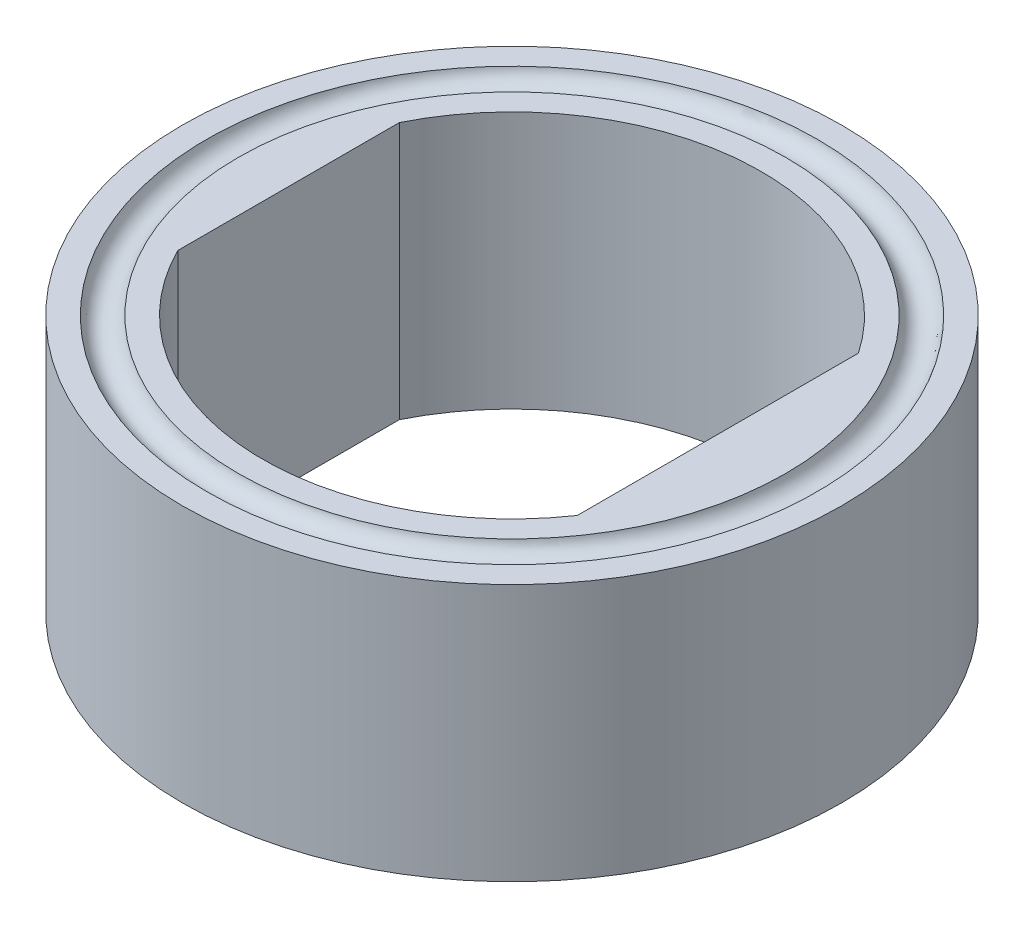
ISO-10303-21;
HEADER;
FILE_DESCRIPTION(('STEP AP214'),'2;1');
FILE_NAME('part.step','',(''),(''),'','','');
FILE_SCHEMA(('AUTOMOTIVE_DESIGN { 1 0 10303 214 1 1 1 1 }'));
ENDSEC;
DATA;
#1=APPLICATION_CONTEXT('core data for automotive mechanical design processes');
#2=APPLICATION_PROTOCOL_DEFINITION('international standard','automotive_design',2000,#1);
#3=PRODUCT_CONTEXT('',#1,'mechanical');
#4=PRODUCT('Part','Part','',(#3));
#5=PRODUCT_RELATED_PRODUCT_CATEGORY('part','',(#4));
#6=PRODUCT_DEFINITION_FORMATION('','',#4);
#7=PRODUCT_DEFINITION_CONTEXT('part definition',#1,'design');
#8=PRODUCT_DEFINITION('design','',#6,#7);
#9=PRODUCT_DEFINITION_SHAPE('','',#8);
#10=(LENGTH_UNIT() NAMED_UNIT(*) SI_UNIT(.MILLI.,.METRE.));
#11=(NAMED_UNIT(*) PLANE_ANGLE_UNIT() SI_UNIT($,.RADIAN.));
#12=(NAMED_UNIT(*) SI_UNIT($,.STERADIAN.) SOLID_ANGLE_UNIT());
#13=UNCERTAINTY_MEASURE_WITH_UNIT(LENGTH_MEASURE(1.E-05),#10,'distance_accuracy_value','');
#14=(GEOMETRIC_REPRESENTATION_CONTEXT(3) GLOBAL_UNCERTAINTY_ASSIGNED_CONTEXT((#13)) GLOBAL_UNIT_ASSIGNED_CONTEXT((#10,
#11,#12)) REPRESENTATION_CONTEXT('',''));
#15=CARTESIAN_POINT('',(0.,0.,0.));
#16=DIRECTION('',(0.,0.,1.));
#17=DIRECTION('',(1.,0.,0.));
#18=AXIS2_PLACEMENT_3D('',#15,#16,#17);
#19=CARTESIAN_POINT('',(0.,25.4,0.));
#20=DIRECTION('',(0.,-1.,0.));
#21=DIRECTION('',(0.,0.,-1.));
#22=AXIS2_PLACEMENT_3D('',#19,#20,#21);
#23=CYLINDRICAL_SURFACE('',#22,49.2125);
#24=DIRECTION('',(0.,1.,0.));
#25=VECTOR('',#24,1.);
#26=CARTESIAN_POINT('',(40.64,-25.4,-27.7535683516553));
#27=LINE('',#26,#25);
#28=CARTESIAN_POINT('',(40.64,-25.4,-27.7535683516553));
#29=VERTEX_POINT('',#28);
#30=CARTESIAN_POINT('',(40.64,25.4,-27.7535683516553));
#31=VERTEX_POINT('',#30);
#32=EDGE_CURVE('E96',#29,#31,#27,.T.);
#33=ORIENTED_EDGE('',*,*,#32,.T.);
#34=CARTESIAN_POINT('',(0.,25.4,0.));
#35=DIRECTION('',(0.,1.,0.));
#36=DIRECTION('',(0.,0.,1.));
#37=AXIS2_PLACEMENT_3D('',#34,#35,#36);
#38=CIRCLE('',#37,49.2125);
#39=CARTESIAN_POINT('',(-44.0944,25.4,-21.853009973228));
#40=VERTEX_POINT('',#39);
#41=EDGE_CURVE('E84',#31,#40,#38,.T.);
#42=ORIENTED_EDGE('',*,*,#41,.T.);
#43=DIRECTION('',(0.,1.,0.));
#44=VECTOR('',#43,1.);
#45=CARTESIAN_POINT('',(-44.0944,-25.4,-21.853009973228));
#46=LINE('',#45,#44);
#47=CARTESIAN_POINT('',(-44.0944,-25.4,-21.853009973228));
#48=VERTEX_POINT('',#47);
#49=EDGE_CURVE('E118',#48,#40,#46,.T.);
#50=ORIENTED_EDGE('',*,*,#49,.F.);
#51=CARTESIAN_POINT('',(0.,-25.4,0.));
#52=DIRECTION('',(0.,1.,0.));
#53=DIRECTION('',(0.,0.,1.));
#54=AXIS2_PLACEMENT_3D('',#51,#52,#53);
#55=CIRCLE('',#54,49.2125);
#56=EDGE_CURVE('E57',#29,#48,#55,.T.);
#57=ORIENTED_EDGE('',*,*,#56,.F.);
#58=EDGE_LOOP('',(#33,#42,#50,#57));
#59=FACE_BOUND('',#58,.T.);
#60=ADVANCED_FACE('F39',(#59),#23,.F.);
#61=CARTESIAN_POINT('',(0.,-25.4,0.));
#62=DIRECTION('',(0.,1.,0.));
#63=DIRECTION('',(0.,0.,1.));
#64=AXIS2_PLACEMENT_3D('',#61,#62,#63);
#65=PLANE('',#64);
#66=CARTESIAN_POINT('',(0.,-25.4,0.));
#67=DIRECTION('',(0.,1.,0.));
#68=DIRECTION('',(0.,0.,1.));
#69=AXIS2_PLACEMENT_3D('',#66,#67,#68);
#70=CIRCLE('',#69,65.0875);
#71=CARTESIAN_POINT('',(0.,-25.4,65.0875));
#72=VERTEX_POINT('',#71);
#73=EDGE_CURVE('E49',#72,#72,#70,.T.);
#74=ORIENTED_EDGE('',*,*,#73,.F.);
#75=EDGE_LOOP('',(#74));
#76=FACE_BOUND('',#75,.T.);
#77=CARTESIAN_POINT('',(0.,-25.4,0.));
#78=DIRECTION('',(0.,1.,0.));
#79=DIRECTION('',(0.,0.,1.));
#80=AXIS2_PLACEMENT_3D('',#77,#78,#79);
#81=CIRCLE('',#80,60.2608519733346);
#82=CARTESIAN_POINT('',(0.,-25.4,60.2608519733346));
#83=VERTEX_POINT('',#82);
#84=EDGE_CURVE('E43',#83,#83,#81,.T.);
#85=ORIENTED_EDGE('',*,*,#84,.T.);
#86=EDGE_LOOP('',(#85));
#87=FACE_BOUND('',#86,.T.);
#88=ADVANCED_FACE('F146',(#76,#87),#65,.F.);
#89=CARTESIAN_POINT('',(-44.0944,-25.4,21.853009973228));
#90=VERTEX_POINT('',#89);
#91=CARTESIAN_POINT('',(40.64,-25.4,27.7535683516553));
#92=VERTEX_POINT('',#91);
#93=EDGE_CURVE('E94',#90,#92,#55,.T.);
#94=ORIENTED_EDGE('',*,*,#93,.T.);
#95=DIRECTION('',(0.,0.,1.));
#96=VECTOR('',#95,1.);
#97=CARTESIAN_POINT('',(40.64,-25.4,-27.7535683516553));
#98=LINE('',#97,#96);
#99=EDGE_CURVE('E101',#29,#92,#98,.T.);
#100=ORIENTED_EDGE('',*,*,#99,.F.);
#101=ORIENTED_EDGE('',*,*,#56,.T.);
#102=DIRECTION('',(0.,0.,-1.));
#103=VECTOR('',#102,1.);
#104=CARTESIAN_POINT('',(-44.0944,-25.4,21.853009973228));
#105=LINE('',#104,#103);
#106=EDGE_CURVE('E111',#90,#48,#105,.T.);
#107=ORIENTED_EDGE('',*,*,#106,.F.);
#108=EDGE_LOOP('',(#94,#100,#101,#107));
#109=FACE_BOUND('',#108,.T.);
#110=CARTESIAN_POINT('',(0.,-25.4,0.));
#111=DIRECTION('',(0.,-1.,0.));
#112=DIRECTION('',(0.,0.,-1.));
#113=AXIS2_PLACEMENT_3D('',#110,#111,#112);
#114=CIRCLE('',#113,54.0391480266654);
#115=CARTESIAN_POINT('',(0.,-25.4,-54.0391480266654));
#116=VERTEX_POINT('',#115);
#117=EDGE_CURVE('E121',#116,#116,#114,.T.);
#118=ORIENTED_EDGE('',*,*,#117,.T.);
#119=EDGE_LOOP('',(#118));
#120=FACE_BOUND('',#119,.T.);
#121=ADVANCED_FACE('F168',(#109,#120),#65,.F.);
#122=CARTESIAN_POINT('',(0.,25.4,0.));
#123=DIRECTION('',(0.,1.,0.));
#124=DIRECTION('',(0.,0.,1.));
#125=AXIS2_PLACEMENT_3D('',#122,#123,#124);
#126=PLANE('',#125);
#127=CARTESIAN_POINT('',(0.,25.4,0.));
#128=DIRECTION('',(0.,1.,0.));
#129=DIRECTION('',(0.,0.,1.));
#130=AXIS2_PLACEMENT_3D('',#127,#128,#129);
#131=CIRCLE('',#130,65.0875);
#132=CARTESIAN_POINT('',(0.,25.4,65.0875));
#133=VERTEX_POINT('',#132);
#134=EDGE_CURVE('E11',#133,#133,#131,.T.);
#135=ORIENTED_EDGE('',*,*,#134,.T.);
#136=EDGE_LOOP('',(#135));
#137=FACE_BOUND('',#136,.T.);
#138=CARTESIAN_POINT('',(0.,25.4,0.));
#139=DIRECTION('',(0.,1.,0.));
#140=DIRECTION('',(0.,0.,1.));
#141=AXIS2_PLACEMENT_3D('',#138,#139,#140);
#142=CIRCLE('',#141,60.2608519733346);
#143=CARTESIAN_POINT('',(0.,25.4,60.2608519733346));
#144=VERTEX_POINT('',#143);
#145=EDGE_CURVE('E135',#144,#144,#142,.T.);
#146=ORIENTED_EDGE('',*,*,#145,.F.);
#147=EDGE_LOOP('',(#146));
#148=FACE_BOUND('',#147,.T.);
#149=ADVANCED_FACE('F179',(#137,#148),#126,.T.);
#150=CARTESIAN_POINT('',(-44.0944,25.4,21.853009973228));
#151=VERTEX_POINT('',#150);
#152=CARTESIAN_POINT('',(40.64,25.4,27.7535683516553));
#153=VERTEX_POINT('',#152);
#154=EDGE_CURVE('E93',#151,#153,#38,.T.);
#155=ORIENTED_EDGE('',*,*,#154,.F.);
#156=DIRECTION('',(0.,0.,-1.));
#157=VECTOR('',#156,1.);
#158=CARTESIAN_POINT('',(-44.0944,25.4,21.853009973228));
#159=LINE('',#158,#157);
#160=EDGE_CURVE('E90',#151,#40,#159,.T.);
#161=ORIENTED_EDGE('',*,*,#160,.T.);
#162=ORIENTED_EDGE('',*,*,#41,.F.);
#163=DIRECTION('',(0.,0.,1.));
#164=VECTOR('',#163,1.);
#165=CARTESIAN_POINT('',(40.64,25.4,-27.7535683516553));
#166=LINE('',#165,#164);
#167=EDGE_CURVE('E88',#31,#153,#166,.T.);
#168=ORIENTED_EDGE('',*,*,#167,.T.);
#169=EDGE_LOOP('',(#155,#161,#162,#168));
#170=FACE_BOUND('',#169,.T.);
#171=CARTESIAN_POINT('',(0.,25.4,0.));
#172=DIRECTION('',(0.,-1.,0.));
#173=DIRECTION('',(0.,0.,-1.));
#174=AXIS2_PLACEMENT_3D('',#171,#172,#173);
#175=CIRCLE('',#174,54.0391480266654);
#176=CARTESIAN_POINT('',(0.,25.4,-54.0391480266654));
#177=VERTEX_POINT('',#176);
#178=EDGE_CURVE('E131',#177,#177,#175,.T.);
#179=ORIENTED_EDGE('',*,*,#178,.F.);
#180=EDGE_LOOP('',(#179));
#181=FACE_BOUND('',#180,.T.);
#182=ADVANCED_FACE('F85',(#170,#181),#126,.T.);
#183=CARTESIAN_POINT('',(0.,25.4,0.));
#184=DIRECTION('',(0.,-1.,0.));
#185=DIRECTION('',(0.,0.,-1.));
#186=AXIS2_PLACEMENT_3D('',#183,#184,#185);
#187=CYLINDRICAL_SURFACE('',#186,65.0875);
#188=ORIENTED_EDGE('',*,*,#134,.F.);
#189=EDGE_LOOP('',(#188));
#190=FACE_BOUND('',#189,.T.);
#191=ORIENTED_EDGE('',*,*,#73,.T.);
#192=EDGE_LOOP('',(#191));
#193=FACE_BOUND('',#192,.T.);
#194=ADVANCED_FACE('F41',(#190,#193),#187,.T.);
#195=DIRECTION('',(0.,1.,0.));
#196=VECTOR('',#195,1.);
#197=CARTESIAN_POINT('',(40.64,-25.4,27.7535683516553));
#198=LINE('',#197,#196);
#199=EDGE_CURVE('E65',#92,#153,#198,.T.);
#200=ORIENTED_EDGE('',*,*,#199,.F.);
#201=ORIENTED_EDGE('',*,*,#93,.F.);
#202=DIRECTION('',(0.,1.,0.));
#203=VECTOR('',#202,1.);
#204=CARTESIAN_POINT('',(-44.0944,-25.4,21.853009973228));
#205=LINE('',#204,#203);
#206=EDGE_CURVE('E115',#90,#151,#205,.T.);
#207=ORIENTED_EDGE('',*,*,#206,.T.);
#208=ORIENTED_EDGE('',*,*,#154,.T.);
#209=EDGE_LOOP('',(#200,#201,#207,#208));
#210=FACE_BOUND('',#209,.T.);
#211=ADVANCED_FACE('F160',(#210),#23,.F.);
#212=CARTESIAN_POINT('',(0.,26.035,0.));
#213=DIRECTION('',(0.,-1.,0.));
#214=DIRECTION('',(0.,0.,-1.));
#215=AXIS2_PLACEMENT_3D('',#212,#213,#214);
#216=TOROIDAL_SURFACE('',#215,57.15,3.175);
#217=ORIENTED_EDGE('',*,*,#145,.T.);
#218=EDGE_LOOP('',(#217));
#219=FACE_BOUND('',#218,.T.);
#220=ORIENTED_EDGE('',*,*,#178,.T.);
#221=EDGE_LOOP('',(#220));
#222=FACE_BOUND('',#221,.T.);
#223=ADVANCED_FACE('F151',(#219,#222),#216,.F.);
#224=CARTESIAN_POINT('',(0.,-26.035,0.));
#225=DIRECTION('',(0.,1.,0.));
#226=DIRECTION('',(0.,0.,-1.));
#227=AXIS2_PLACEMENT_3D('',#224,#225,#226);
#228=TOROIDAL_SURFACE('',#227,57.15,3.175);
#229=ORIENTED_EDGE('',*,*,#117,.F.);
#230=EDGE_LOOP('',(#229));
#231=FACE_BOUND('',#230,.T.);
#232=ORIENTED_EDGE('',*,*,#84,.F.);
#233=EDGE_LOOP('',(#232));
#234=FACE_BOUND('',#233,.T.);
#235=ADVANCED_FACE('F148',(#231,#234),#228,.F.);
#236=CARTESIAN_POINT('',(-44.0944,-25.4,21.853009973228));
#237=DIRECTION('',(1.,0.,0.));
#238=DIRECTION('',(0.,0.,-1.));
#239=AXIS2_PLACEMENT_3D('',#236,#237,#238);
#240=PLANE('',#239);
#241=ORIENTED_EDGE('',*,*,#160,.F.);
#242=ORIENTED_EDGE('',*,*,#206,.F.);
#243=ORIENTED_EDGE('',*,*,#106,.T.);
#244=ORIENTED_EDGE('',*,*,#49,.T.);
#245=EDGE_LOOP('',(#241,#242,#243,#244));
#246=FACE_BOUND('',#245,.T.);
#247=ADVANCED_FACE('F150',(#246),#240,.T.);
#248=CARTESIAN_POINT('',(40.64,-25.4,-27.7535683516553));
#249=DIRECTION('',(-1.,0.,0.));
#250=DIRECTION('',(0.,0.,1.));
#251=AXIS2_PLACEMENT_3D('',#248,#249,#250);
#252=PLANE('',#251);
#253=ORIENTED_EDGE('',*,*,#167,.F.);
#254=ORIENTED_EDGE('',*,*,#32,.F.);
#255=ORIENTED_EDGE('',*,*,#99,.T.);
#256=ORIENTED_EDGE('',*,*,#199,.T.);
#257=EDGE_LOOP('',(#253,#254,#255,#256));
#258=FACE_BOUND('',#257,.T.);
#259=ADVANCED_FACE('F103',(#258),#252,.T.);
#260=CLOSED_SHELL('',(#60,#88,#121,#149,#182,#194,#211,#223,#235,#247,#259));
#261=MANIFOLD_SOLID_BREP('B2',#260);
#262=ADVANCED_BREP_SHAPE_REPRESENTATION('',(#18,#261),#14);
#263=SHAPE_DEFINITION_REPRESENTATION(#9,#262);
ENDSEC;
END-ISO-10303-21;
